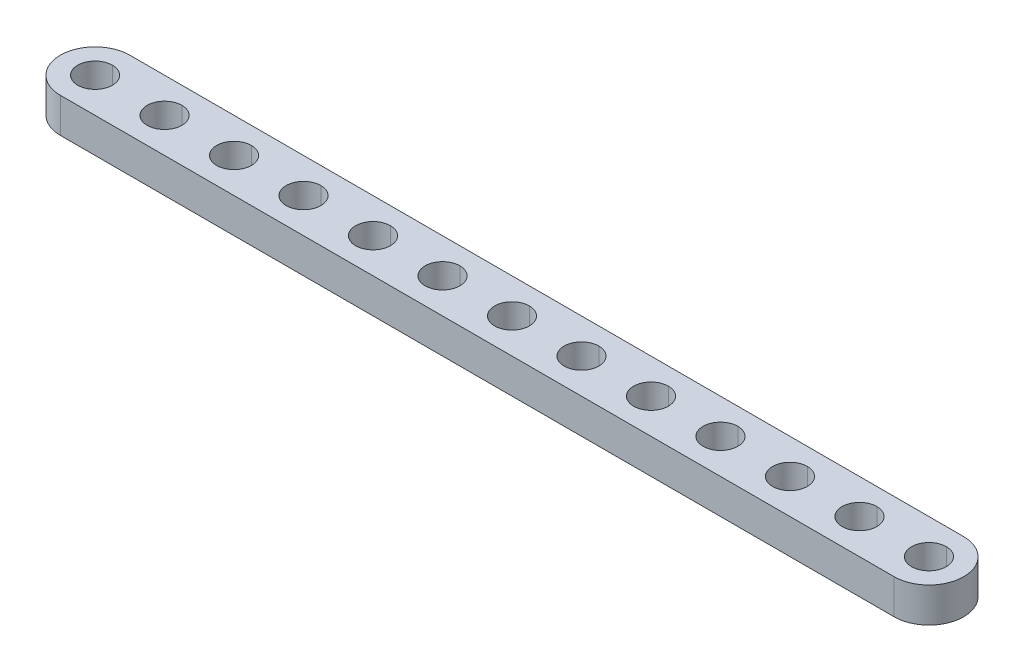
ISO-10303-21;
HEADER;
FILE_DESCRIPTION(('STEP AP214'),'2;1');
FILE_NAME('part.step','',(''),(''),'','','');
FILE_SCHEMA(('AUTOMOTIVE_DESIGN { 1 0 10303 214 1 1 1 1 }'));
ENDSEC;
DATA;
#1=APPLICATION_CONTEXT('core data for automotive mechanical design processes');
#2=APPLICATION_PROTOCOL_DEFINITION('international standard','automotive_design',2000,#1);
#3=PRODUCT_CONTEXT('',#1,'mechanical');
#4=PRODUCT('Part','Part','',(#3));
#5=PRODUCT_RELATED_PRODUCT_CATEGORY('part','',(#4));
#6=PRODUCT_DEFINITION_FORMATION('','',#4);
#7=PRODUCT_DEFINITION_CONTEXT('part definition',#1,'design');
#8=PRODUCT_DEFINITION('design','',#6,#7);
#9=PRODUCT_DEFINITION_SHAPE('','',#8);
#10=(LENGTH_UNIT() NAMED_UNIT(*) SI_UNIT(.MILLI.,.METRE.));
#11=(NAMED_UNIT(*) PLANE_ANGLE_UNIT() SI_UNIT($,.RADIAN.));
#12=(NAMED_UNIT(*) SI_UNIT($,.STERADIAN.) SOLID_ANGLE_UNIT());
#13=UNCERTAINTY_MEASURE_WITH_UNIT(LENGTH_MEASURE(1.E-05),#10,'distance_accuracy_value','');
#14=(GEOMETRIC_REPRESENTATION_CONTEXT(3) GLOBAL_UNCERTAINTY_ASSIGNED_CONTEXT((#13)) GLOBAL_UNIT_ASSIGNED_CONTEXT((#10,
#11,#12)) REPRESENTATION_CONTEXT('',''));
#15=CARTESIAN_POINT('',(0.,0.,0.));
#16=DIRECTION('',(0.,0.,1.));
#17=DIRECTION('',(1.,0.,0.));
#18=AXIS2_PLACEMENT_3D('',#15,#16,#17);
#19=CARTESIAN_POINT('',(48.,4.,0.));
#20=DIRECTION('',(0.,1.,0.));
#21=DIRECTION('',(0.,0.,1.));
#22=AXIS2_PLACEMENT_3D('',#19,#20,#21);
#23=CYLINDRICAL_SURFACE('',#22,2.);
#24=DIRECTION('',(0.,1.,0.));
#25=VECTOR('',#24,1.);
#26=CARTESIAN_POINT('',(48.,4.,-2.));
#27=LINE('',#26,#25);
#28=CARTESIAN_POINT('',(48.,0.,-2.));
#29=VERTEX_POINT('',#28);
#30=CARTESIAN_POINT('',(48.,4.,-2.));
#31=VERTEX_POINT('',#30);
#32=EDGE_CURVE('E343',#29,#31,#27,.T.);
#33=ORIENTED_EDGE('',*,*,#32,.F.);
#34=CARTESIAN_POINT('',(48.,0.,0.));
#35=DIRECTION('',(0.,1.,0.));
#36=DIRECTION('',(0.,0.,1.));
#37=AXIS2_PLACEMENT_3D('',#34,#35,#36);
#38=CIRCLE('',#37,2.);
#39=CARTESIAN_POINT('',(48.,0.,2.));
#40=VERTEX_POINT('',#39);
#41=EDGE_CURVE('E283',#40,#29,#38,.T.);
#42=ORIENTED_EDGE('',*,*,#41,.F.);
#43=DIRECTION('',(0.,1.,0.));
#44=VECTOR('',#43,1.);
#45=CARTESIAN_POINT('',(48.,4.,2.));
#46=LINE('',#45,#44);
#47=CARTESIAN_POINT('',(48.,4.,2.));
#48=VERTEX_POINT('',#47);
#49=EDGE_CURVE('E342',#40,#48,#46,.T.);
#50=ORIENTED_EDGE('',*,*,#49,.T.);
#51=CARTESIAN_POINT('',(48.,4.,0.));
#52=DIRECTION('',(0.,1.,0.));
#53=DIRECTION('',(0.,0.,1.));
#54=AXIS2_PLACEMENT_3D('',#51,#52,#53);
#55=CIRCLE('',#54,2.);
#56=EDGE_CURVE('E308',#48,#31,#55,.T.);
#57=ORIENTED_EDGE('',*,*,#56,.T.);
#58=EDGE_LOOP('',(#33,#42,#50,#57));
#59=FACE_BOUND('',#58,.T.);
#60=ADVANCED_FACE('F15',(#59),#23,.F.);
#61=CARTESIAN_POINT('',(40.,4.,0.));
#62=DIRECTION('',(0.,1.,0.));
#63=DIRECTION('',(0.,0.,1.));
#64=AXIS2_PLACEMENT_3D('',#61,#62,#63);
#65=CYLINDRICAL_SURFACE('',#64,2.);
#66=DIRECTION('',(0.,1.,0.));
#67=VECTOR('',#66,1.);
#68=CARTESIAN_POINT('',(40.,4.,-2.));
#69=LINE('',#68,#67);
#70=CARTESIAN_POINT('',(40.,0.,-2.));
#71=VERTEX_POINT('',#70);
#72=CARTESIAN_POINT('',(40.,4.,-2.));
#73=VERTEX_POINT('',#72);
#74=EDGE_CURVE('E311',#71,#73,#69,.T.);
#75=ORIENTED_EDGE('',*,*,#74,.F.);
#76=CARTESIAN_POINT('',(40.,0.,0.));
#77=DIRECTION('',(0.,1.,0.));
#78=DIRECTION('',(0.,0.,1.));
#79=AXIS2_PLACEMENT_3D('',#76,#77,#78);
#80=CIRCLE('',#79,2.);
#81=CARTESIAN_POINT('',(40.,0.,2.));
#82=VERTEX_POINT('',#81);
#83=EDGE_CURVE('E492',#82,#71,#80,.T.);
#84=ORIENTED_EDGE('',*,*,#83,.F.);
#85=DIRECTION('',(0.,1.,0.));
#86=VECTOR('',#85,1.);
#87=CARTESIAN_POINT('',(40.,4.,2.));
#88=LINE('',#87,#86);
#89=CARTESIAN_POINT('',(40.,4.,2.));
#90=VERTEX_POINT('',#89);
#91=EDGE_CURVE('E333',#82,#90,#88,.T.);
#92=ORIENTED_EDGE('',*,*,#91,.T.);
#93=CARTESIAN_POINT('',(40.,4.,0.));
#94=DIRECTION('',(0.,1.,0.));
#95=DIRECTION('',(0.,0.,1.));
#96=AXIS2_PLACEMENT_3D('',#93,#94,#95);
#97=CIRCLE('',#96,2.);
#98=EDGE_CURVE('E310',#90,#73,#97,.T.);
#99=ORIENTED_EDGE('',*,*,#98,.T.);
#100=EDGE_LOOP('',(#75,#84,#92,#99));
#101=FACE_BOUND('',#100,.T.);
#102=ADVANCED_FACE('F683',(#101),#65,.F.);
#103=CARTESIAN_POINT('',(32.,4.,0.));
#104=DIRECTION('',(0.,1.,0.));
#105=DIRECTION('',(0.,0.,1.));
#106=AXIS2_PLACEMENT_3D('',#103,#104,#105);
#107=CYLINDRICAL_SURFACE('',#106,2.);
#108=DIRECTION('',(0.,1.,0.));
#109=VECTOR('',#108,1.);
#110=CARTESIAN_POINT('',(32.,4.,-2.));
#111=LINE('',#110,#109);
#112=CARTESIAN_POINT('',(32.,0.,-2.));
#113=VERTEX_POINT('',#112);
#114=CARTESIAN_POINT('',(32.,4.,-2.));
#115=VERTEX_POINT('',#114);
#116=EDGE_CURVE('E456',#113,#115,#111,.T.);
#117=ORIENTED_EDGE('',*,*,#116,.F.);
#118=CARTESIAN_POINT('',(32.,0.,0.));
#119=DIRECTION('',(0.,1.,0.));
#120=DIRECTION('',(0.,0.,1.));
#121=AXIS2_PLACEMENT_3D('',#118,#119,#120);
#122=CIRCLE('',#121,2.);
#123=CARTESIAN_POINT('',(32.,0.,2.));
#124=VERTEX_POINT('',#123);
#125=EDGE_CURVE('E464',#124,#113,#122,.T.);
#126=ORIENTED_EDGE('',*,*,#125,.F.);
#127=DIRECTION('',(0.,1.,0.));
#128=VECTOR('',#127,1.);
#129=CARTESIAN_POINT('',(32.,4.,2.));
#130=LINE('',#129,#128);
#131=CARTESIAN_POINT('',(32.,4.,2.));
#132=VERTEX_POINT('',#131);
#133=EDGE_CURVE('E455',#124,#132,#130,.T.);
#134=ORIENTED_EDGE('',*,*,#133,.T.);
#135=CARTESIAN_POINT('',(32.,4.,0.));
#136=DIRECTION('',(0.,1.,0.));
#137=DIRECTION('',(0.,0.,1.));
#138=AXIS2_PLACEMENT_3D('',#135,#136,#137);
#139=CIRCLE('',#138,2.);
#140=EDGE_CURVE('E417',#132,#115,#139,.T.);
#141=ORIENTED_EDGE('',*,*,#140,.T.);
#142=EDGE_LOOP('',(#117,#126,#134,#141));
#143=FACE_BOUND('',#142,.T.);
#144=ADVANCED_FACE('F1034',(#143),#107,.F.);
#145=CARTESIAN_POINT('',(24.,4.,0.));
#146=DIRECTION('',(0.,1.,0.));
#147=DIRECTION('',(0.,0.,1.));
#148=AXIS2_PLACEMENT_3D('',#145,#146,#147);
#149=CYLINDRICAL_SURFACE('',#148,2.);
#150=DIRECTION('',(0.,1.,0.));
#151=VECTOR('',#150,1.);
#152=CARTESIAN_POINT('',(24.,4.,-2.));
#153=LINE('',#152,#151);
#154=CARTESIAN_POINT('',(24.,0.,-2.));
#155=VERTEX_POINT('',#154);
#156=CARTESIAN_POINT('',(24.,4.,-2.));
#157=VERTEX_POINT('',#156);
#158=EDGE_CURVE('E372',#155,#157,#153,.T.);
#159=ORIENTED_EDGE('',*,*,#158,.F.);
#160=CARTESIAN_POINT('',(24.,0.,0.));
#161=DIRECTION('',(0.,1.,0.));
#162=DIRECTION('',(0.,0.,1.));
#163=AXIS2_PLACEMENT_3D('',#160,#161,#162);
#164=CIRCLE('',#163,2.);
#165=CARTESIAN_POINT('',(24.,0.,2.));
#166=VERTEX_POINT('',#165);
#167=EDGE_CURVE('E460',#166,#155,#164,.T.);
#168=ORIENTED_EDGE('',*,*,#167,.F.);
#169=DIRECTION('',(0.,1.,0.));
#170=VECTOR('',#169,1.);
#171=CARTESIAN_POINT('',(24.,4.,2.));
#172=LINE('',#171,#170);
#173=CARTESIAN_POINT('',(24.,4.,2.));
#174=VERTEX_POINT('',#173);
#175=EDGE_CURVE('E328',#166,#174,#172,.T.);
#176=ORIENTED_EDGE('',*,*,#175,.T.);
#177=CARTESIAN_POINT('',(24.,4.,0.));
#178=DIRECTION('',(0.,1.,0.));
#179=DIRECTION('',(0.,0.,1.));
#180=AXIS2_PLACEMENT_3D('',#177,#178,#179);
#181=CIRCLE('',#180,2.);
#182=EDGE_CURVE('E431',#174,#157,#181,.T.);
#183=ORIENTED_EDGE('',*,*,#182,.T.);
#184=EDGE_LOOP('',(#159,#168,#176,#183));
#185=FACE_BOUND('',#184,.T.);
#186=ADVANCED_FACE('F1038',(#185),#149,.F.);
#187=CARTESIAN_POINT('',(16.,4.,0.));
#188=DIRECTION('',(0.,1.,0.));
#189=DIRECTION('',(0.,0.,1.));
#190=AXIS2_PLACEMENT_3D('',#187,#188,#189);
#191=CYLINDRICAL_SURFACE('',#190,2.);
#192=DIRECTION('',(0.,1.,0.));
#193=VECTOR('',#192,1.);
#194=CARTESIAN_POINT('',(16.,4.,-2.));
#195=LINE('',#194,#193);
#196=CARTESIAN_POINT('',(16.,0.,-2.));
#197=VERTEX_POINT('',#196);
#198=CARTESIAN_POINT('',(16.,4.,-2.));
#199=VERTEX_POINT('',#198);
#200=EDGE_CURVE('E327',#197,#199,#195,.T.);
#201=ORIENTED_EDGE('',*,*,#200,.F.);
#202=CARTESIAN_POINT('',(16.,0.,0.));
#203=DIRECTION('',(0.,1.,0.));
#204=DIRECTION('',(0.,0.,1.));
#205=AXIS2_PLACEMENT_3D('',#202,#203,#204);
#206=CIRCLE('',#205,2.);
#207=CARTESIAN_POINT('',(16.,0.,2.));
#208=VERTEX_POINT('',#207);
#209=EDGE_CURVE('E463',#208,#197,#206,.T.);
#210=ORIENTED_EDGE('',*,*,#209,.F.);
#211=DIRECTION('',(0.,1.,0.));
#212=VECTOR('',#211,1.);
#213=CARTESIAN_POINT('',(16.,4.,2.));
#214=LINE('',#213,#212);
#215=CARTESIAN_POINT('',(16.,4.,2.));
#216=VERTEX_POINT('',#215);
#217=EDGE_CURVE('E392',#208,#216,#214,.T.);
#218=ORIENTED_EDGE('',*,*,#217,.T.);
#219=CARTESIAN_POINT('',(16.,4.,0.));
#220=DIRECTION('',(0.,1.,0.));
#221=DIRECTION('',(0.,0.,1.));
#222=AXIS2_PLACEMENT_3D('',#219,#220,#221);
#223=CIRCLE('',#222,2.);
#224=EDGE_CURVE('E427',#216,#199,#223,.T.);
#225=ORIENTED_EDGE('',*,*,#224,.T.);
#226=EDGE_LOOP('',(#201,#210,#218,#225));
#227=FACE_BOUND('',#226,.T.);
#228=ADVANCED_FACE('F996',(#227),#191,.F.);
#229=CARTESIAN_POINT('',(8.,4.,0.));
#230=DIRECTION('',(0.,1.,0.));
#231=DIRECTION('',(0.,0.,1.));
#232=AXIS2_PLACEMENT_3D('',#229,#230,#231);
#233=CYLINDRICAL_SURFACE('',#232,2.);
#234=DIRECTION('',(0.,1.,0.));
#235=VECTOR('',#234,1.);
#236=CARTESIAN_POINT('',(8.,4.,-2.));
#237=LINE('',#236,#235);
#238=CARTESIAN_POINT('',(8.,0.,-2.));
#239=VERTEX_POINT('',#238);
#240=CARTESIAN_POINT('',(8.,4.,-2.));
#241=VERTEX_POINT('',#240);
#242=EDGE_CURVE('E423',#239,#241,#237,.T.);
#243=ORIENTED_EDGE('',*,*,#242,.F.);
#244=CARTESIAN_POINT('',(8.,0.,0.));
#245=DIRECTION('',(0.,1.,0.));
#246=DIRECTION('',(0.,0.,1.));
#247=AXIS2_PLACEMENT_3D('',#244,#245,#246);
#248=CIRCLE('',#247,2.);
#249=CARTESIAN_POINT('',(8.,0.,2.));
#250=VERTEX_POINT('',#249);
#251=EDGE_CURVE('E480',#250,#239,#248,.T.);
#252=ORIENTED_EDGE('',*,*,#251,.F.);
#253=DIRECTION('',(0.,1.,0.));
#254=VECTOR('',#253,1.);
#255=CARTESIAN_POINT('',(8.,4.,2.));
#256=LINE('',#255,#254);
#257=CARTESIAN_POINT('',(8.,4.,2.));
#258=VERTEX_POINT('',#257);
#259=EDGE_CURVE('E422',#250,#258,#256,.T.);
#260=ORIENTED_EDGE('',*,*,#259,.T.);
#261=CARTESIAN_POINT('',(8.,4.,0.));
#262=DIRECTION('',(0.,1.,0.));
#263=DIRECTION('',(0.,0.,1.));
#264=AXIS2_PLACEMENT_3D('',#261,#262,#263);
#265=CIRCLE('',#264,2.);
#266=EDGE_CURVE('E430',#258,#241,#265,.T.);
#267=ORIENTED_EDGE('',*,*,#266,.T.);
#268=EDGE_LOOP('',(#243,#252,#260,#267));
#269=FACE_BOUND('',#268,.T.);
#270=ADVANCED_FACE('F650',(#269),#233,.F.);
#271=CARTESIAN_POINT('',(0.,4.,0.));
#272=DIRECTION('',(0.,1.,0.));
#273=DIRECTION('',(0.,0.,1.));
#274=AXIS2_PLACEMENT_3D('',#271,#272,#273);
#275=CYLINDRICAL_SURFACE('',#274,2.);
#276=DIRECTION('',(0.,1.,0.));
#277=VECTOR('',#276,1.);
#278=CARTESIAN_POINT('',(0.,4.,-2.));
#279=LINE('',#278,#277);
#280=CARTESIAN_POINT('',(0.,0.,-2.));
#281=VERTEX_POINT('',#280);
#282=CARTESIAN_POINT('',(0.,4.,-2.));
#283=VERTEX_POINT('',#282);
#284=EDGE_CURVE('E509',#281,#283,#279,.T.);
#285=ORIENTED_EDGE('',*,*,#284,.F.);
#286=CARTESIAN_POINT('',(0.,0.,0.));
#287=DIRECTION('',(0.,1.,0.));
#288=DIRECTION('',(0.,0.,1.));
#289=AXIS2_PLACEMENT_3D('',#286,#287,#288);
#290=CIRCLE('',#289,2.);
#291=CARTESIAN_POINT('',(0.,0.,2.));
#292=VERTEX_POINT('',#291);
#293=EDGE_CURVE('E477',#292,#281,#290,.T.);
#294=ORIENTED_EDGE('',*,*,#293,.F.);
#295=DIRECTION('',(0.,1.,0.));
#296=VECTOR('',#295,1.);
#297=CARTESIAN_POINT('',(0.,4.,2.));
#298=LINE('',#297,#296);
#299=CARTESIAN_POINT('',(0.,4.,2.));
#300=VERTEX_POINT('',#299);
#301=EDGE_CURVE('E405',#292,#300,#298,.T.);
#302=ORIENTED_EDGE('',*,*,#301,.T.);
#303=CARTESIAN_POINT('',(0.,4.,0.));
#304=DIRECTION('',(0.,1.,0.));
#305=DIRECTION('',(0.,0.,1.));
#306=AXIS2_PLACEMENT_3D('',#303,#304,#305);
#307=CIRCLE('',#306,2.);
#308=EDGE_CURVE('E486',#300,#283,#307,.T.);
#309=ORIENTED_EDGE('',*,*,#308,.T.);
#310=EDGE_LOOP('',(#285,#294,#302,#309));
#311=FACE_BOUND('',#310,.T.);
#312=ADVANCED_FACE('F567',(#311),#275,.F.);
#313=CARTESIAN_POINT('',(-8.,4.,0.));
#314=DIRECTION('',(0.,1.,0.));
#315=DIRECTION('',(0.,0.,1.));
#316=AXIS2_PLACEMENT_3D('',#313,#314,#315);
#317=CYLINDRICAL_SURFACE('',#316,2.);
#318=DIRECTION('',(0.,1.,0.));
#319=VECTOR('',#318,1.);
#320=CARTESIAN_POINT('',(-8.,4.,-2.));
#321=LINE('',#320,#319);
#322=CARTESIAN_POINT('',(-8.,0.,-2.));
#323=VERTEX_POINT('',#322);
#324=CARTESIAN_POINT('',(-8.,4.,-2.));
#325=VERTEX_POINT('',#324);
#326=EDGE_CURVE('E445',#323,#325,#321,.T.);
#327=ORIENTED_EDGE('',*,*,#326,.F.);
#328=CARTESIAN_POINT('',(-8.,0.,0.));
#329=DIRECTION('',(0.,1.,0.));
#330=DIRECTION('',(0.,0.,1.));
#331=AXIS2_PLACEMENT_3D('',#328,#329,#330);
#332=CIRCLE('',#331,2.);
#333=CARTESIAN_POINT('',(-8.,0.,2.));
#334=VERTEX_POINT('',#333);
#335=EDGE_CURVE('E467',#334,#323,#332,.T.);
#336=ORIENTED_EDGE('',*,*,#335,.F.);
#337=DIRECTION('',(0.,1.,0.));
#338=VECTOR('',#337,1.);
#339=CARTESIAN_POINT('',(-8.,4.,2.));
#340=LINE('',#339,#338);
#341=CARTESIAN_POINT('',(-8.,4.,2.));
#342=VERTEX_POINT('',#341);
#343=EDGE_CURVE('E378',#334,#342,#340,.T.);
#344=ORIENTED_EDGE('',*,*,#343,.T.);
#345=CARTESIAN_POINT('',(-8.,4.,0.));
#346=DIRECTION('',(0.,1.,0.));
#347=DIRECTION('',(0.,0.,1.));
#348=AXIS2_PLACEMENT_3D('',#345,#346,#347);
#349=CIRCLE('',#348,2.);
#350=EDGE_CURVE('E512',#342,#325,#349,.T.);
#351=ORIENTED_EDGE('',*,*,#350,.T.);
#352=EDGE_LOOP('',(#327,#336,#344,#351));
#353=FACE_BOUND('',#352,.T.);
#354=ADVANCED_FACE('F971',(#353),#317,.F.);
#355=CARTESIAN_POINT('',(-16.,4.,0.));
#356=DIRECTION('',(0.,1.,0.));
#357=DIRECTION('',(0.,0.,1.));
#358=AXIS2_PLACEMENT_3D('',#355,#356,#357);
#359=CYLINDRICAL_SURFACE('',#358,2.);
#360=DIRECTION('',(0.,1.,0.));
#361=VECTOR('',#360,1.);
#362=CARTESIAN_POINT('',(-16.,4.,-2.));
#363=LINE('',#362,#361);
#364=CARTESIAN_POINT('',(-16.,0.,-2.));
#365=VERTEX_POINT('',#364);
#366=CARTESIAN_POINT('',(-16.,4.,-2.));
#367=VERTEX_POINT('',#366);
#368=EDGE_CURVE('E516',#365,#367,#363,.T.);
#369=ORIENTED_EDGE('',*,*,#368,.F.);
#370=CARTESIAN_POINT('',(-16.,0.,0.));
#371=DIRECTION('',(0.,1.,0.));
#372=DIRECTION('',(0.,0.,1.));
#373=AXIS2_PLACEMENT_3D('',#370,#371,#372);
#374=CIRCLE('',#373,2.);
#375=CARTESIAN_POINT('',(-16.,0.,2.));
#376=VERTEX_POINT('',#375);
#377=EDGE_CURVE('E72',#376,#365,#374,.T.);
#378=ORIENTED_EDGE('',*,*,#377,.F.);
#379=DIRECTION('',(0.,1.,0.));
#380=VECTOR('',#379,1.);
#381=CARTESIAN_POINT('',(-16.,4.,2.));
#382=LINE('',#381,#380);
#383=CARTESIAN_POINT('',(-16.,4.,2.));
#384=VERTEX_POINT('',#383);
#385=EDGE_CURVE('E373',#376,#384,#382,.T.);
#386=ORIENTED_EDGE('',*,*,#385,.T.);
#387=CARTESIAN_POINT('',(-16.,4.,0.));
#388=DIRECTION('',(0.,1.,0.));
#389=DIRECTION('',(0.,0.,1.));
#390=AXIS2_PLACEMENT_3D('',#387,#388,#389);
#391=CIRCLE('',#390,2.);
#392=EDGE_CURVE('E357',#384,#367,#391,.T.);
#393=ORIENTED_EDGE('',*,*,#392,.T.);
#394=EDGE_LOOP('',(#369,#378,#386,#393));
#395=FACE_BOUND('',#394,.T.);
#396=ADVANCED_FACE('F966',(#395),#359,.F.);
#397=CARTESIAN_POINT('',(-24.,4.,0.));
#398=DIRECTION('',(0.,1.,0.));
#399=DIRECTION('',(0.,0.,1.));
#400=AXIS2_PLACEMENT_3D('',#397,#398,#399);
#401=CYLINDRICAL_SURFACE('',#400,2.);
#402=DIRECTION('',(0.,1.,0.));
#403=VECTOR('',#402,1.);
#404=CARTESIAN_POINT('',(-24.,4.,-2.));
#405=LINE('',#404,#403);
#406=CARTESIAN_POINT('',(-24.,0.,-2.));
#407=VERTEX_POINT('',#406);
#408=CARTESIAN_POINT('',(-24.,4.,-2.));
#409=VERTEX_POINT('',#408);
#410=EDGE_CURVE('E387',#407,#409,#405,.T.);
#411=ORIENTED_EDGE('',*,*,#410,.F.);
#412=CARTESIAN_POINT('',(-24.,0.,0.));
#413=DIRECTION('',(0.,1.,0.));
#414=DIRECTION('',(0.,0.,1.));
#415=AXIS2_PLACEMENT_3D('',#412,#413,#414);
#416=CIRCLE('',#415,2.);
#417=CARTESIAN_POINT('',(-24.,0.,2.));
#418=VERTEX_POINT('',#417);
#419=EDGE_CURVE('E362',#418,#407,#416,.T.);
#420=ORIENTED_EDGE('',*,*,#419,.F.);
#421=DIRECTION('',(0.,1.,0.));
#422=VECTOR('',#421,1.);
#423=CARTESIAN_POINT('',(-24.,4.,2.));
#424=LINE('',#423,#422);
#425=CARTESIAN_POINT('',(-24.,4.,2.));
#426=VERTEX_POINT('',#425);
#427=EDGE_CURVE('E317',#418,#426,#424,.T.);
#428=ORIENTED_EDGE('',*,*,#427,.T.);
#429=CARTESIAN_POINT('',(-24.,4.,0.));
#430=DIRECTION('',(0.,1.,0.));
#431=DIRECTION('',(0.,0.,1.));
#432=AXIS2_PLACEMENT_3D('',#429,#430,#431);
#433=CIRCLE('',#432,2.);
#434=EDGE_CURVE('E353',#426,#409,#433,.T.);
#435=ORIENTED_EDGE('',*,*,#434,.T.);
#436=EDGE_LOOP('',(#411,#420,#428,#435));
#437=FACE_BOUND('',#436,.T.);
#438=ADVANCED_FACE('F970',(#437),#401,.F.);
#439=CARTESIAN_POINT('',(-32.,4.,0.));
#440=DIRECTION('',(0.,1.,0.));
#441=DIRECTION('',(0.,0.,1.));
#442=AXIS2_PLACEMENT_3D('',#439,#440,#441);
#443=CYLINDRICAL_SURFACE('',#442,2.);
#444=DIRECTION('',(0.,1.,0.));
#445=VECTOR('',#444,1.);
#446=CARTESIAN_POINT('',(-32.,4.,-2.));
#447=LINE('',#446,#445);
#448=CARTESIAN_POINT('',(-32.,0.,-2.));
#449=VERTEX_POINT('',#448);
#450=CARTESIAN_POINT('',(-32.,4.,-2.));
#451=VERTEX_POINT('',#450);
#452=EDGE_CURVE('E404',#449,#451,#447,.T.);
#453=ORIENTED_EDGE('',*,*,#452,.F.);
#454=CARTESIAN_POINT('',(-32.,0.,0.));
#455=DIRECTION('',(0.,1.,0.));
#456=DIRECTION('',(0.,0.,1.));
#457=AXIS2_PLACEMENT_3D('',#454,#455,#456);
#458=CIRCLE('',#457,2.);
#459=CARTESIAN_POINT('',(-32.,0.,2.));
#460=VERTEX_POINT('',#459);
#461=EDGE_CURVE('E365',#460,#449,#458,.T.);
#462=ORIENTED_EDGE('',*,*,#461,.F.);
#463=DIRECTION('',(0.,1.,0.));
#464=VECTOR('',#463,1.);
#465=CARTESIAN_POINT('',(-32.,4.,2.));
#466=LINE('',#465,#464);
#467=CARTESIAN_POINT('',(-32.,4.,2.));
#468=VERTEX_POINT('',#467);
#469=EDGE_CURVE('E432',#460,#468,#466,.T.);
#470=ORIENTED_EDGE('',*,*,#469,.T.);
#471=CARTESIAN_POINT('',(-32.,4.,0.));
#472=DIRECTION('',(0.,1.,0.));
#473=DIRECTION('',(0.,0.,1.));
#474=AXIS2_PLACEMENT_3D('',#471,#472,#473);
#475=CIRCLE('',#474,2.);
#476=EDGE_CURVE('E356',#468,#451,#475,.T.);
#477=ORIENTED_EDGE('',*,*,#476,.T.);
#478=EDGE_LOOP('',(#453,#462,#470,#477));
#479=FACE_BOUND('',#478,.T.);
#480=ADVANCED_FACE('F1001',(#479),#443,.F.);
#481=CARTESIAN_POINT('',(-40.,4.,0.));
#482=DIRECTION('',(0.,1.,0.));
#483=DIRECTION('',(0.,0.,1.));
#484=AXIS2_PLACEMENT_3D('',#481,#482,#483);
#485=CYLINDRICAL_SURFACE('',#484,2.);
#486=DIRECTION('',(0.,1.,0.));
#487=VECTOR('',#486,1.);
#488=CARTESIAN_POINT('',(-40.,4.,-2.));
#489=LINE('',#488,#487);
#490=CARTESIAN_POINT('',(-40.,0.,-2.));
#491=VERTEX_POINT('',#490);
#492=CARTESIAN_POINT('',(-40.,4.,-2.));
#493=VERTEX_POINT('',#492);
#494=EDGE_CURVE('E344',#491,#493,#489,.T.);
#495=ORIENTED_EDGE('',*,*,#494,.F.);
#496=CARTESIAN_POINT('',(-40.,0.,0.));
#497=DIRECTION('',(0.,1.,0.));
#498=DIRECTION('',(0.,0.,1.));
#499=AXIS2_PLACEMENT_3D('',#496,#497,#498);
#500=CIRCLE('',#499,2.);
#501=CARTESIAN_POINT('',(-40.,0.,2.));
#502=VERTEX_POINT('',#501);
#503=EDGE_CURVE('E25',#502,#491,#500,.T.);
#504=ORIENTED_EDGE('',*,*,#503,.F.);
#505=DIRECTION('',(0.,1.,0.));
#506=VECTOR('',#505,1.);
#507=CARTESIAN_POINT('',(-40.,4.,2.));
#508=LINE('',#507,#506);
#509=CARTESIAN_POINT('',(-40.,4.,2.));
#510=VERTEX_POINT('',#509);
#511=EDGE_CURVE('E302',#502,#510,#508,.T.);
#512=ORIENTED_EDGE('',*,*,#511,.T.);
#513=CARTESIAN_POINT('',(-40.,4.,0.));
#514=DIRECTION('',(0.,1.,0.));
#515=DIRECTION('',(0.,0.,1.));
#516=AXIS2_PLACEMENT_3D('',#513,#514,#515);
#517=CIRCLE('',#516,2.);
#518=EDGE_CURVE('E284',#510,#493,#517,.T.);
#519=ORIENTED_EDGE('',*,*,#518,.T.);
#520=EDGE_LOOP('',(#495,#504,#512,#519));
#521=FACE_BOUND('',#520,.T.);
#522=ADVANCED_FACE('F1005',(#521),#485,.F.);
#523=CARTESIAN_POINT('',(-48.,4.,0.));
#524=DIRECTION('',(0.,1.,0.));
#525=DIRECTION('',(0.,0.,1.));
#526=AXIS2_PLACEMENT_3D('',#523,#524,#525);
#527=CYLINDRICAL_SURFACE('',#526,2.);
#528=DIRECTION('',(0.,1.,0.));
#529=VECTOR('',#528,1.);
#530=CARTESIAN_POINT('',(-48.,4.,-2.));
#531=LINE('',#530,#529);
#532=CARTESIAN_POINT('',(-48.,0.,-2.));
#533=VERTEX_POINT('',#532);
#534=CARTESIAN_POINT('',(-48.,4.,-2.));
#535=VERTEX_POINT('',#534);
#536=EDGE_CURVE('E276',#533,#535,#531,.T.);
#537=ORIENTED_EDGE('',*,*,#536,.F.);
#538=CARTESIAN_POINT('',(-48.,0.,0.));
#539=DIRECTION('',(0.,1.,0.));
#540=DIRECTION('',(0.,0.,1.));
#541=AXIS2_PLACEMENT_3D('',#538,#539,#540);
#542=CIRCLE('',#541,2.);
#543=CARTESIAN_POINT('',(-48.,0.,2.));
#544=VERTEX_POINT('',#543);
#545=EDGE_CURVE('E10',#544,#533,#542,.T.);
#546=ORIENTED_EDGE('',*,*,#545,.F.);
#547=DIRECTION('',(0.,1.,0.));
#548=VECTOR('',#547,1.);
#549=CARTESIAN_POINT('',(-48.,4.,2.));
#550=LINE('',#549,#548);
#551=CARTESIAN_POINT('',(-48.,4.,2.));
#552=VERTEX_POINT('',#551);
#553=EDGE_CURVE('E279',#544,#552,#550,.T.);
#554=ORIENTED_EDGE('',*,*,#553,.T.);
#555=CARTESIAN_POINT('',(-48.,4.,0.));
#556=DIRECTION('',(0.,1.,0.));
#557=DIRECTION('',(0.,0.,1.));
#558=AXIS2_PLACEMENT_3D('',#555,#556,#557);
#559=CIRCLE('',#558,2.);
#560=EDGE_CURVE('E272',#552,#535,#559,.T.);
#561=ORIENTED_EDGE('',*,*,#560,.T.);
#562=EDGE_LOOP('',(#537,#546,#554,#561));
#563=FACE_BOUND('',#562,.T.);
#564=ADVANCED_FACE('F274',(#563),#527,.F.);
#565=CARTESIAN_POINT('',(-48.,0.,0.));
#566=DIRECTION('',(0.,1.,0.));
#567=DIRECTION('',(1.,0.,0.));
#568=AXIS2_PLACEMENT_3D('',#565,#566,#567);
#569=PLANE('',#568);
#570=ORIENTED_EDGE('',*,*,#545,.T.);
#571=CARTESIAN_POINT('',(-48.,0.,0.));
#572=DIRECTION('',(0.,1.,0.));
#573=DIRECTION('',(0.,0.,1.));
#574=AXIS2_PLACEMENT_3D('',#571,#572,#573);
#575=CIRCLE('',#574,2.);
#576=EDGE_CURVE('E294',#533,#544,#575,.T.);
#577=ORIENTED_EDGE('',*,*,#576,.T.);
#578=EDGE_LOOP('',(#570,#577));
#579=FACE_BOUND('',#578,.T.);
#580=ORIENTED_EDGE('',*,*,#503,.T.);
#581=CARTESIAN_POINT('',(-40.,0.,0.));
#582=DIRECTION('',(0.,1.,0.));
#583=DIRECTION('',(0.,0.,1.));
#584=AXIS2_PLACEMENT_3D('',#581,#582,#583);
#585=CIRCLE('',#584,2.);
#586=EDGE_CURVE('E349',#491,#502,#585,.T.);
#587=ORIENTED_EDGE('',*,*,#586,.T.);
#588=EDGE_LOOP('',(#580,#587));
#589=FACE_BOUND('',#588,.T.);
#590=ORIENTED_EDGE('',*,*,#461,.T.);
#591=CARTESIAN_POINT('',(-32.,0.,0.));
#592=DIRECTION('',(0.,1.,0.));
#593=DIRECTION('',(0.,0.,1.));
#594=AXIS2_PLACEMENT_3D('',#591,#592,#593);
#595=CIRCLE('',#594,2.);
#596=EDGE_CURVE('E321',#449,#460,#595,.T.);
#597=ORIENTED_EDGE('',*,*,#596,.T.);
#598=EDGE_LOOP('',(#590,#597));
#599=FACE_BOUND('',#598,.T.);
#600=ORIENTED_EDGE('',*,*,#419,.T.);
#601=CARTESIAN_POINT('',(-24.,0.,0.));
#602=DIRECTION('',(0.,1.,0.));
#603=DIRECTION('',(0.,0.,1.));
#604=AXIS2_PLACEMENT_3D('',#601,#602,#603);
#605=CIRCLE('',#604,2.);
#606=EDGE_CURVE('E376',#407,#418,#605,.T.);
#607=ORIENTED_EDGE('',*,*,#606,.T.);
#608=EDGE_LOOP('',(#600,#607));
#609=FACE_BOUND('',#608,.T.);
#610=ORIENTED_EDGE('',*,*,#377,.T.);
#611=CARTESIAN_POINT('',(-16.,0.,0.));
#612=DIRECTION('',(0.,1.,0.));
#613=DIRECTION('',(0.,0.,1.));
#614=AXIS2_PLACEMENT_3D('',#611,#612,#613);
#615=CIRCLE('',#614,2.);
#616=EDGE_CURVE('E382',#365,#376,#615,.T.);
#617=ORIENTED_EDGE('',*,*,#616,.T.);
#618=EDGE_LOOP('',(#610,#617));
#619=FACE_BOUND('',#618,.T.);
#620=ORIENTED_EDGE('',*,*,#335,.T.);
#621=CARTESIAN_POINT('',(-8.,0.,0.));
#622=DIRECTION('',(0.,1.,0.));
#623=DIRECTION('',(0.,0.,1.));
#624=AXIS2_PLACEMENT_3D('',#621,#622,#623);
#625=CIRCLE('',#624,2.);
#626=EDGE_CURVE('E409',#323,#334,#625,.T.);
#627=ORIENTED_EDGE('',*,*,#626,.T.);
#628=EDGE_LOOP('',(#620,#627));
#629=FACE_BOUND('',#628,.T.);
#630=ORIENTED_EDGE('',*,*,#293,.T.);
#631=CARTESIAN_POINT('',(0.,0.,0.));
#632=DIRECTION('',(0.,1.,0.));
#633=DIRECTION('',(0.,0.,1.));
#634=AXIS2_PLACEMENT_3D('',#631,#632,#633);
#635=CIRCLE('',#634,2.);
#636=EDGE_CURVE('E474',#281,#292,#635,.T.);
#637=ORIENTED_EDGE('',*,*,#636,.T.);
#638=EDGE_LOOP('',(#630,#637));
#639=FACE_BOUND('',#638,.T.);
#640=ORIENTED_EDGE('',*,*,#251,.T.);
#641=CARTESIAN_POINT('',(8.,0.,0.));
#642=DIRECTION('',(0.,1.,0.));
#643=DIRECTION('',(0.,0.,1.));
#644=AXIS2_PLACEMENT_3D('',#641,#642,#643);
#645=CIRCLE('',#644,2.);
#646=EDGE_CURVE('E523',#239,#250,#645,.T.);
#647=ORIENTED_EDGE('',*,*,#646,.T.);
#648=EDGE_LOOP('',(#640,#647));
#649=FACE_BOUND('',#648,.T.);
#650=ORIENTED_EDGE('',*,*,#209,.T.);
#651=CARTESIAN_POINT('',(16.,0.,0.));
#652=DIRECTION('',(0.,1.,0.));
#653=DIRECTION('',(0.,0.,1.));
#654=AXIS2_PLACEMENT_3D('',#651,#652,#653);
#655=CIRCLE('',#654,2.);
#656=EDGE_CURVE('E323',#197,#208,#655,.T.);
#657=ORIENTED_EDGE('',*,*,#656,.T.);
#658=EDGE_LOOP('',(#650,#657));
#659=FACE_BOUND('',#658,.T.);
#660=ORIENTED_EDGE('',*,*,#167,.T.);
#661=CARTESIAN_POINT('',(24.,0.,0.));
#662=DIRECTION('',(0.,1.,0.));
#663=DIRECTION('',(0.,0.,1.));
#664=AXIS2_PLACEMENT_3D('',#661,#662,#663);
#665=CIRCLE('',#664,2.);
#666=EDGE_CURVE('E499',#155,#166,#665,.T.);
#667=ORIENTED_EDGE('',*,*,#666,.T.);
#668=EDGE_LOOP('',(#660,#667));
#669=FACE_BOUND('',#668,.T.);
#670=ORIENTED_EDGE('',*,*,#125,.T.);
#671=CARTESIAN_POINT('',(32.,0.,0.));
#672=DIRECTION('',(0.,1.,0.));
#673=DIRECTION('',(0.,0.,1.));
#674=AXIS2_PLACEMENT_3D('',#671,#672,#673);
#675=CIRCLE('',#674,2.);
#676=EDGE_CURVE('E337',#113,#124,#675,.T.);
#677=ORIENTED_EDGE('',*,*,#676,.T.);
#678=EDGE_LOOP('',(#670,#677));
#679=FACE_BOUND('',#678,.T.);
#680=ORIENTED_EDGE('',*,*,#83,.T.);
#681=CARTESIAN_POINT('',(40.,0.,0.));
#682=DIRECTION('',(0.,1.,0.));
#683=DIRECTION('',(0.,0.,1.));
#684=AXIS2_PLACEMENT_3D('',#681,#682,#683);
#685=CIRCLE('',#684,2.);
#686=EDGE_CURVE('E316',#71,#82,#685,.T.);
#687=ORIENTED_EDGE('',*,*,#686,.T.);
#688=EDGE_LOOP('',(#680,#687));
#689=FACE_BOUND('',#688,.T.);
#690=ORIENTED_EDGE('',*,*,#41,.T.);
#691=CARTESIAN_POINT('',(48.,0.,0.));
#692=DIRECTION('',(0.,1.,0.));
#693=DIRECTION('',(0.,0.,1.));
#694=AXIS2_PLACEMENT_3D('',#691,#692,#693);
#695=CIRCLE('',#694,2.);
#696=EDGE_CURVE('E500',#29,#40,#695,.T.);
#697=ORIENTED_EDGE('',*,*,#696,.T.);
#698=EDGE_LOOP('',(#690,#697));
#699=FACE_BOUND('',#698,.T.);
#700=CARTESIAN_POINT('',(-48.,0.,0.));
#701=DIRECTION('',(0.,1.,0.));
#702=DIRECTION('',(0.,0.,1.));
#703=AXIS2_PLACEMENT_3D('',#700,#701,#702);
#704=CIRCLE('',#703,4.);
#705=CARTESIAN_POINT('',(-48.,0.,-4.));
#706=VERTEX_POINT('',#705);
#707=CARTESIAN_POINT('',(-48.,0.,4.));
#708=VERTEX_POINT('',#707);
#709=EDGE_CURVE('E440',#706,#708,#704,.T.);
#710=ORIENTED_EDGE('',*,*,#709,.F.);
#711=DIRECTION('',(-1.,0.,0.));
#712=VECTOR('',#711,1.);
#713=CARTESIAN_POINT('',(-48.,0.,-4.));
#714=LINE('',#713,#712);
#715=CARTESIAN_POINT('',(48.,0.,-4.));
#716=VERTEX_POINT('',#715);
#717=EDGE_CURVE('E368',#716,#706,#714,.T.);
#718=ORIENTED_EDGE('',*,*,#717,.F.);
#719=CARTESIAN_POINT('',(48.,0.,0.));
#720=DIRECTION('',(0.,1.,0.));
#721=DIRECTION('',(0.,0.,1.));
#722=AXIS2_PLACEMENT_3D('',#719,#720,#721);
#723=CIRCLE('',#722,4.);
#724=CARTESIAN_POINT('',(48.,0.,4.));
#725=VERTEX_POINT('',#724);
#726=EDGE_CURVE('E306',#725,#716,#723,.T.);
#727=ORIENTED_EDGE('',*,*,#726,.F.);
#728=DIRECTION('',(1.,0.,0.));
#729=VECTOR('',#728,1.);
#730=CARTESIAN_POINT('',(-48.,0.,4.));
#731=LINE('',#730,#729);
#732=EDGE_CURVE('E393',#708,#725,#731,.T.);
#733=ORIENTED_EDGE('',*,*,#732,.F.);
#734=EDGE_LOOP('',(#710,#718,#727,#733));
#735=FACE_BOUND('',#734,.T.);
#736=ADVANCED_FACE('F547',(#579,#589,#599,#609,#619,#629,#639,#649,#659,#669,#679,#689,#699,
#735),#569,.F.);
#737=CARTESIAN_POINT('',(-48.,4.,0.));
#738=DIRECTION('',(0.,1.,0.));
#739=DIRECTION('',(1.,0.,0.));
#740=AXIS2_PLACEMENT_3D('',#737,#738,#739);
#741=PLANE('',#740);
#742=ORIENTED_EDGE('',*,*,#560,.F.);
#743=CARTESIAN_POINT('',(-48.,4.,0.));
#744=DIRECTION('',(0.,1.,0.));
#745=DIRECTION('',(0.,0.,1.));
#746=AXIS2_PLACEMENT_3D('',#743,#744,#745);
#747=CIRCLE('',#746,2.);
#748=EDGE_CURVE('E286',#535,#552,#747,.T.);
#749=ORIENTED_EDGE('',*,*,#748,.F.);
#750=EDGE_LOOP('',(#742,#749));
#751=FACE_BOUND('',#750,.T.);
#752=ORIENTED_EDGE('',*,*,#518,.F.);
#753=CARTESIAN_POINT('',(-40.,4.,0.));
#754=DIRECTION('',(0.,1.,0.));
#755=DIRECTION('',(0.,0.,1.));
#756=AXIS2_PLACEMENT_3D('',#753,#754,#755);
#757=CIRCLE('',#756,2.);
#758=EDGE_CURVE('E348',#493,#510,#757,.T.);
#759=ORIENTED_EDGE('',*,*,#758,.F.);
#760=EDGE_LOOP('',(#752,#759));
#761=FACE_BOUND('',#760,.T.);
#762=ORIENTED_EDGE('',*,*,#476,.F.);
#763=CARTESIAN_POINT('',(-32.,4.,0.));
#764=DIRECTION('',(0.,1.,0.));
#765=DIRECTION('',(0.,0.,1.));
#766=AXIS2_PLACEMENT_3D('',#763,#764,#765);
#767=CIRCLE('',#766,2.);
#768=EDGE_CURVE('E435',#451,#468,#767,.T.);
#769=ORIENTED_EDGE('',*,*,#768,.F.);
#770=EDGE_LOOP('',(#762,#769));
#771=FACE_BOUND('',#770,.T.);
#772=ORIENTED_EDGE('',*,*,#434,.F.);
#773=CARTESIAN_POINT('',(-24.,4.,0.));
#774=DIRECTION('',(0.,1.,0.));
#775=DIRECTION('',(0.,0.,1.));
#776=AXIS2_PLACEMENT_3D('',#773,#774,#775);
#777=CIRCLE('',#776,2.);
#778=EDGE_CURVE('E322',#409,#426,#777,.T.);
#779=ORIENTED_EDGE('',*,*,#778,.F.);
#780=EDGE_LOOP('',(#772,#779));
#781=FACE_BOUND('',#780,.T.);
#782=ORIENTED_EDGE('',*,*,#392,.F.);
#783=CARTESIAN_POINT('',(-16.,4.,0.));
#784=DIRECTION('',(0.,1.,0.));
#785=DIRECTION('',(0.,0.,1.));
#786=AXIS2_PLACEMENT_3D('',#783,#784,#785);
#787=CIRCLE('',#786,2.);
#788=EDGE_CURVE('E377',#367,#384,#787,.T.);
#789=ORIENTED_EDGE('',*,*,#788,.F.);
#790=EDGE_LOOP('',(#782,#789));
#791=FACE_BOUND('',#790,.T.);
#792=ORIENTED_EDGE('',*,*,#350,.F.);
#793=CARTESIAN_POINT('',(-8.,4.,0.));
#794=DIRECTION('',(0.,1.,0.));
#795=DIRECTION('',(0.,0.,1.));
#796=AXIS2_PLACEMENT_3D('',#793,#794,#795);
#797=CIRCLE('',#796,2.);
#798=EDGE_CURVE('E383',#325,#342,#797,.T.);
#799=ORIENTED_EDGE('',*,*,#798,.F.);
#800=EDGE_LOOP('',(#792,#799));
#801=FACE_BOUND('',#800,.T.);
#802=ORIENTED_EDGE('',*,*,#308,.F.);
#803=CARTESIAN_POINT('',(0.,4.,0.));
#804=DIRECTION('',(0.,1.,0.));
#805=DIRECTION('',(0.,0.,1.));
#806=AXIS2_PLACEMENT_3D('',#803,#804,#805);
#807=CIRCLE('',#806,2.);
#808=EDGE_CURVE('E410',#283,#300,#807,.T.);
#809=ORIENTED_EDGE('',*,*,#808,.F.);
#810=EDGE_LOOP('',(#802,#809));
#811=FACE_BOUND('',#810,.T.);
#812=ORIENTED_EDGE('',*,*,#266,.F.);
#813=CARTESIAN_POINT('',(8.,4.,0.));
#814=DIRECTION('',(0.,1.,0.));
#815=DIRECTION('',(0.,0.,1.));
#816=AXIS2_PLACEMENT_3D('',#813,#814,#815);
#817=CIRCLE('',#816,2.);
#818=EDGE_CURVE('E418',#241,#258,#817,.T.);
#819=ORIENTED_EDGE('',*,*,#818,.F.);
#820=EDGE_LOOP('',(#812,#819));
#821=FACE_BOUND('',#820,.T.);
#822=ORIENTED_EDGE('',*,*,#224,.F.);
#823=CARTESIAN_POINT('',(16.,4.,0.));
#824=DIRECTION('',(0.,1.,0.));
#825=DIRECTION('',(0.,0.,1.));
#826=AXIS2_PLACEMENT_3D('',#823,#824,#825);
#827=CIRCLE('',#826,2.);
#828=EDGE_CURVE('E388',#199,#216,#827,.T.);
#829=ORIENTED_EDGE('',*,*,#828,.F.);
#830=EDGE_LOOP('',(#822,#829));
#831=FACE_BOUND('',#830,.T.);
#832=ORIENTED_EDGE('',*,*,#182,.F.);
#833=CARTESIAN_POINT('',(24.,4.,0.));
#834=DIRECTION('',(0.,1.,0.));
#835=DIRECTION('',(0.,0.,1.));
#836=AXIS2_PLACEMENT_3D('',#833,#834,#835);
#837=CIRCLE('',#836,2.);
#838=EDGE_CURVE('E332',#157,#174,#837,.T.);
#839=ORIENTED_EDGE('',*,*,#838,.F.);
#840=EDGE_LOOP('',(#832,#839));
#841=FACE_BOUND('',#840,.T.);
#842=ORIENTED_EDGE('',*,*,#140,.F.);
#843=CARTESIAN_POINT('',(32.,4.,0.));
#844=DIRECTION('',(0.,1.,0.));
#845=DIRECTION('',(0.,0.,1.));
#846=AXIS2_PLACEMENT_3D('',#843,#844,#845);
#847=CIRCLE('',#846,2.);
#848=EDGE_CURVE('E451',#115,#132,#847,.T.);
#849=ORIENTED_EDGE('',*,*,#848,.F.);
#850=EDGE_LOOP('',(#842,#849));
#851=FACE_BOUND('',#850,.T.);
#852=ORIENTED_EDGE('',*,*,#98,.F.);
#853=CARTESIAN_POINT('',(40.,4.,0.));
#854=DIRECTION('',(0.,1.,0.));
#855=DIRECTION('',(0.,0.,1.));
#856=AXIS2_PLACEMENT_3D('',#853,#854,#855);
#857=CIRCLE('',#856,2.);
#858=EDGE_CURVE('E315',#73,#90,#857,.T.);
#859=ORIENTED_EDGE('',*,*,#858,.F.);
#860=EDGE_LOOP('',(#852,#859));
#861=FACE_BOUND('',#860,.T.);
#862=ORIENTED_EDGE('',*,*,#56,.F.);
#863=CARTESIAN_POINT('',(48.,4.,0.));
#864=DIRECTION('',(0.,1.,0.));
#865=DIRECTION('',(0.,0.,1.));
#866=AXIS2_PLACEMENT_3D('',#863,#864,#865);
#867=CIRCLE('',#866,2.);
#868=EDGE_CURVE('E338',#31,#48,#867,.T.);
#869=ORIENTED_EDGE('',*,*,#868,.F.);
#870=EDGE_LOOP('',(#862,#869));
#871=FACE_BOUND('',#870,.T.);
#872=CARTESIAN_POINT('',(-48.,4.,0.));
#873=DIRECTION('',(0.,1.,0.));
#874=DIRECTION('',(0.,0.,1.));
#875=AXIS2_PLACEMENT_3D('',#872,#873,#874);
#876=CIRCLE('',#875,4.);
#877=CARTESIAN_POINT('',(-48.,4.,-4.));
#878=VERTEX_POINT('',#877);
#879=CARTESIAN_POINT('',(-48.,4.,4.));
#880=VERTEX_POINT('',#879);
#881=EDGE_CURVE('E18',#878,#880,#876,.T.);
#882=ORIENTED_EDGE('',*,*,#881,.T.);
#883=DIRECTION('',(1.,0.,0.));
#884=VECTOR('',#883,1.);
#885=CARTESIAN_POINT('',(-48.,4.,4.));
#886=LINE('',#885,#884);
#887=CARTESIAN_POINT('',(48.,4.,4.));
#888=VERTEX_POINT('',#887);
#889=EDGE_CURVE('E414',#880,#888,#886,.T.);
#890=ORIENTED_EDGE('',*,*,#889,.T.);
#891=CARTESIAN_POINT('',(48.,4.,0.));
#892=DIRECTION('',(0.,1.,0.));
#893=DIRECTION('',(0.,0.,1.));
#894=AXIS2_PLACEMENT_3D('',#891,#892,#893);
#895=CIRCLE('',#894,4.);
#896=CARTESIAN_POINT('',(48.,4.,-4.));
#897=VERTEX_POINT('',#896);
#898=EDGE_CURVE('E361',#888,#897,#895,.T.);
#899=ORIENTED_EDGE('',*,*,#898,.T.);
#900=DIRECTION('',(-1.,0.,0.));
#901=VECTOR('',#900,1.);
#902=CARTESIAN_POINT('',(-48.,4.,-4.));
#903=LINE('',#902,#901);
#904=EDGE_CURVE('E40',#897,#878,#903,.T.);
#905=ORIENTED_EDGE('',*,*,#904,.T.);
#906=EDGE_LOOP('',(#882,#890,#899,#905));
#907=FACE_BOUND('',#906,.T.);
#908=ADVANCED_FACE('F287',(#751,#761,#771,#781,#791,#801,#811,#821,#831,#841,#851,#861,#871,
#907),#741,.T.);
#909=CARTESIAN_POINT('',(-48.,4.,-4.));
#910=DIRECTION('',(0.,0.,1.));
#911=DIRECTION('',(1.,0.,0.));
#912=AXIS2_PLACEMENT_3D('',#909,#910,#911);
#913=PLANE('',#912);
#914=ORIENTED_EDGE('',*,*,#717,.T.);
#915=DIRECTION('',(0.,-1.,0.));
#916=VECTOR('',#915,1.);
#917=CARTESIAN_POINT('',(-48.,4.,-4.));
#918=LINE('',#917,#916);
#919=EDGE_CURVE('E398',#878,#706,#918,.T.);
#920=ORIENTED_EDGE('',*,*,#919,.F.);
#921=ORIENTED_EDGE('',*,*,#904,.F.);
#922=DIRECTION('',(0.,-1.,0.));
#923=VECTOR('',#922,1.);
#924=CARTESIAN_POINT('',(48.,4.,-4.));
#925=LINE('',#924,#923);
#926=EDGE_CURVE('E358',#897,#716,#925,.T.);
#927=ORIENTED_EDGE('',*,*,#926,.T.);
#928=EDGE_LOOP('',(#914,#920,#921,#927));
#929=FACE_BOUND('',#928,.T.);
#930=ADVANCED_FACE('F618',(#929),#913,.F.);
#931=CARTESIAN_POINT('',(48.,4.,0.));
#932=DIRECTION('',(0.,-1.,0.));
#933=DIRECTION('',(0.,0.,-1.));
#934=AXIS2_PLACEMENT_3D('',#931,#932,#933);
#935=CYLINDRICAL_SURFACE('',#934,4.);
#936=ORIENTED_EDGE('',*,*,#726,.T.);
#937=ORIENTED_EDGE('',*,*,#926,.F.);
#938=ORIENTED_EDGE('',*,*,#898,.F.);
#939=DIRECTION('',(0.,-1.,0.));
#940=VECTOR('',#939,1.);
#941=CARTESIAN_POINT('',(48.,4.,4.));
#942=LINE('',#941,#940);
#943=EDGE_CURVE('E397',#888,#725,#942,.T.);
#944=ORIENTED_EDGE('',*,*,#943,.T.);
#945=EDGE_LOOP('',(#936,#937,#938,#944));
#946=FACE_BOUND('',#945,.T.);
#947=ADVANCED_FACE('F617',(#946),#935,.T.);
#948=CARTESIAN_POINT('',(-48.,4.,4.));
#949=DIRECTION('',(0.,0.,-1.));
#950=DIRECTION('',(0.,-1.,0.));
#951=AXIS2_PLACEMENT_3D('',#948,#949,#950);
#952=PLANE('',#951);
#953=ORIENTED_EDGE('',*,*,#732,.T.);
#954=ORIENTED_EDGE('',*,*,#943,.F.);
#955=ORIENTED_EDGE('',*,*,#889,.F.);
#956=DIRECTION('',(0.,-1.,0.));
#957=VECTOR('',#956,1.);
#958=CARTESIAN_POINT('',(-48.,4.,4.));
#959=LINE('',#958,#957);
#960=EDGE_CURVE('E444',#880,#708,#959,.T.);
#961=ORIENTED_EDGE('',*,*,#960,.T.);
#962=EDGE_LOOP('',(#953,#954,#955,#961));
#963=FACE_BOUND('',#962,.T.);
#964=ADVANCED_FACE('F626',(#963),#952,.F.);
#965=CARTESIAN_POINT('',(-48.,4.,0.));
#966=DIRECTION('',(0.,-1.,0.));
#967=DIRECTION('',(0.,0.,-1.));
#968=AXIS2_PLACEMENT_3D('',#965,#966,#967);
#969=CYLINDRICAL_SURFACE('',#968,4.);
#970=ORIENTED_EDGE('',*,*,#709,.T.);
#971=ORIENTED_EDGE('',*,*,#960,.F.);
#972=ORIENTED_EDGE('',*,*,#881,.F.);
#973=ORIENTED_EDGE('',*,*,#919,.T.);
#974=EDGE_LOOP('',(#970,#971,#972,#973));
#975=FACE_BOUND('',#974,.T.);
#976=ADVANCED_FACE('F623',(#975),#969,.T.);
#977=CARTESIAN_POINT('',(-48.,4.,0.));
#978=DIRECTION('',(0.,1.,0.));
#979=DIRECTION('',(0.,0.,1.));
#980=AXIS2_PLACEMENT_3D('',#977,#978,#979);
#981=CYLINDRICAL_SURFACE('',#980,2.);
#982=ORIENTED_EDGE('',*,*,#576,.F.);
#983=ORIENTED_EDGE('',*,*,#536,.T.);
#984=ORIENTED_EDGE('',*,*,#748,.T.);
#985=ORIENTED_EDGE('',*,*,#553,.F.);
#986=EDGE_LOOP('',(#982,#983,#984,#985));
#987=FACE_BOUND('',#986,.T.);
#988=ADVANCED_FACE('F292',(#987),#981,.F.);
#989=CARTESIAN_POINT('',(-40.,4.,0.));
#990=DIRECTION('',(0.,1.,0.));
#991=DIRECTION('',(0.,0.,1.));
#992=AXIS2_PLACEMENT_3D('',#989,#990,#991);
#993=CYLINDRICAL_SURFACE('',#992,2.);
#994=ORIENTED_EDGE('',*,*,#586,.F.);
#995=ORIENTED_EDGE('',*,*,#494,.T.);
#996=ORIENTED_EDGE('',*,*,#758,.T.);
#997=ORIENTED_EDGE('',*,*,#511,.F.);
#998=EDGE_LOOP('',(#994,#995,#996,#997));
#999=FACE_BOUND('',#998,.T.);
#1000=ADVANCED_FACE('F953',(#999),#993,.F.);
#1001=CARTESIAN_POINT('',(-32.,4.,0.));
#1002=DIRECTION('',(0.,1.,0.));
#1003=DIRECTION('',(0.,0.,1.));
#1004=AXIS2_PLACEMENT_3D('',#1001,#1002,#1003);
#1005=CYLINDRICAL_SURFACE('',#1004,2.);
#1006=ORIENTED_EDGE('',*,*,#596,.F.);
#1007=ORIENTED_EDGE('',*,*,#452,.T.);
#1008=ORIENTED_EDGE('',*,*,#768,.T.);
#1009=ORIENTED_EDGE('',*,*,#469,.F.);
#1010=EDGE_LOOP('',(#1006,#1007,#1008,#1009));
#1011=FACE_BOUND('',#1010,.T.);
#1012=ADVANCED_FACE('F948',(#1011),#1005,.F.);
#1013=CARTESIAN_POINT('',(-24.,4.,0.));
#1014=DIRECTION('',(0.,1.,0.));
#1015=DIRECTION('',(0.,0.,1.));
#1016=AXIS2_PLACEMENT_3D('',#1013,#1014,#1015);
#1017=CYLINDRICAL_SURFACE('',#1016,2.);
#1018=ORIENTED_EDGE('',*,*,#606,.F.);
#1019=ORIENTED_EDGE('',*,*,#410,.T.);
#1020=ORIENTED_EDGE('',*,*,#778,.T.);
#1021=ORIENTED_EDGE('',*,*,#427,.F.);
#1022=EDGE_LOOP('',(#1018,#1019,#1020,#1021));
#1023=FACE_BOUND('',#1022,.T.);
#1024=ADVANCED_FACE('F952',(#1023),#1017,.F.);
#1025=CARTESIAN_POINT('',(-16.,4.,0.));
#1026=DIRECTION('',(0.,1.,0.));
#1027=DIRECTION('',(0.,0.,1.));
#1028=AXIS2_PLACEMENT_3D('',#1025,#1026,#1027);
#1029=CYLINDRICAL_SURFACE('',#1028,2.);
#1030=ORIENTED_EDGE('',*,*,#616,.F.);
#1031=ORIENTED_EDGE('',*,*,#368,.T.);
#1032=ORIENTED_EDGE('',*,*,#788,.T.);
#1033=ORIENTED_EDGE('',*,*,#385,.F.);
#1034=EDGE_LOOP('',(#1030,#1031,#1032,#1033));
#1035=FACE_BOUND('',#1034,.T.);
#1036=ADVANCED_FACE('F979',(#1035),#1029,.F.);
#1037=CARTESIAN_POINT('',(-8.,4.,0.));
#1038=DIRECTION('',(0.,1.,0.));
#1039=DIRECTION('',(0.,0.,1.));
#1040=AXIS2_PLACEMENT_3D('',#1037,#1038,#1039);
#1041=CYLINDRICAL_SURFACE('',#1040,2.);
#1042=ORIENTED_EDGE('',*,*,#626,.F.);
#1043=ORIENTED_EDGE('',*,*,#326,.T.);
#1044=ORIENTED_EDGE('',*,*,#798,.T.);
#1045=ORIENTED_EDGE('',*,*,#343,.F.);
#1046=EDGE_LOOP('',(#1042,#1043,#1044,#1045));
#1047=FACE_BOUND('',#1046,.T.);
#1048=ADVANCED_FACE('F552',(#1047),#1041,.F.);
#1049=CARTESIAN_POINT('',(0.,4.,0.));
#1050=DIRECTION('',(0.,1.,0.));
#1051=DIRECTION('',(0.,0.,1.));
#1052=AXIS2_PLACEMENT_3D('',#1049,#1050,#1051);
#1053=CYLINDRICAL_SURFACE('',#1052,2.);
#1054=ORIENTED_EDGE('',*,*,#636,.F.);
#1055=ORIENTED_EDGE('',*,*,#284,.T.);
#1056=ORIENTED_EDGE('',*,*,#808,.T.);
#1057=ORIENTED_EDGE('',*,*,#301,.F.);
#1058=EDGE_LOOP('',(#1054,#1055,#1056,#1057));
#1059=FACE_BOUND('',#1058,.T.);
#1060=ADVANCED_FACE('F571',(#1059),#1053,.F.);
#1061=CARTESIAN_POINT('',(8.,4.,0.));
#1062=DIRECTION('',(0.,1.,0.));
#1063=DIRECTION('',(0.,0.,1.));
#1064=AXIS2_PLACEMENT_3D('',#1061,#1062,#1063);
#1065=CYLINDRICAL_SURFACE('',#1064,2.);
#1066=ORIENTED_EDGE('',*,*,#646,.F.);
#1067=ORIENTED_EDGE('',*,*,#242,.T.);
#1068=ORIENTED_EDGE('',*,*,#818,.T.);
#1069=ORIENTED_EDGE('',*,*,#259,.F.);
#1070=EDGE_LOOP('',(#1066,#1067,#1068,#1069));
#1071=FACE_BOUND('',#1070,.T.);
#1072=ADVANCED_FACE('F653',(#1071),#1065,.F.);
#1073=CARTESIAN_POINT('',(16.,4.,0.));
#1074=DIRECTION('',(0.,1.,0.));
#1075=DIRECTION('',(0.,0.,1.));
#1076=AXIS2_PLACEMENT_3D('',#1073,#1074,#1075);
#1077=CYLINDRICAL_SURFACE('',#1076,2.);
#1078=ORIENTED_EDGE('',*,*,#656,.F.);
#1079=ORIENTED_EDGE('',*,*,#200,.T.);
#1080=ORIENTED_EDGE('',*,*,#828,.T.);
#1081=ORIENTED_EDGE('',*,*,#217,.F.);
#1082=EDGE_LOOP('',(#1078,#1079,#1080,#1081));
#1083=FACE_BOUND('',#1082,.T.);
#1084=ADVANCED_FACE('F935',(#1083),#1077,.F.);
#1085=CARTESIAN_POINT('',(24.,4.,0.));
#1086=DIRECTION('',(0.,1.,0.));
#1087=DIRECTION('',(0.,0.,1.));
#1088=AXIS2_PLACEMENT_3D('',#1085,#1086,#1087);
#1089=CYLINDRICAL_SURFACE('',#1088,2.);
#1090=ORIENTED_EDGE('',*,*,#666,.F.);
#1091=ORIENTED_EDGE('',*,*,#158,.T.);
#1092=ORIENTED_EDGE('',*,*,#838,.T.);
#1093=ORIENTED_EDGE('',*,*,#175,.F.);
#1094=EDGE_LOOP('',(#1090,#1091,#1092,#1093));
#1095=FACE_BOUND('',#1094,.T.);
#1096=ADVANCED_FACE('F930',(#1095),#1089,.F.);
#1097=CARTESIAN_POINT('',(32.,4.,0.));
#1098=DIRECTION('',(0.,1.,0.));
#1099=DIRECTION('',(0.,0.,1.));
#1100=AXIS2_PLACEMENT_3D('',#1097,#1098,#1099);
#1101=CYLINDRICAL_SURFACE('',#1100,2.);
#1102=ORIENTED_EDGE('',*,*,#676,.F.);
#1103=ORIENTED_EDGE('',*,*,#116,.T.);
#1104=ORIENTED_EDGE('',*,*,#848,.T.);
#1105=ORIENTED_EDGE('',*,*,#133,.F.);
#1106=EDGE_LOOP('',(#1102,#1103,#1104,#1105));
#1107=FACE_BOUND('',#1106,.T.);
#1108=ADVANCED_FACE('F934',(#1107),#1101,.F.);
#1109=CARTESIAN_POINT('',(40.,4.,0.));
#1110=DIRECTION('',(0.,1.,0.));
#1111=DIRECTION('',(0.,0.,1.));
#1112=AXIS2_PLACEMENT_3D('',#1109,#1110,#1111);
#1113=CYLINDRICAL_SURFACE('',#1112,2.);
#1114=ORIENTED_EDGE('',*,*,#686,.F.);
#1115=ORIENTED_EDGE('',*,*,#74,.T.);
#1116=ORIENTED_EDGE('',*,*,#858,.T.);
#1117=ORIENTED_EDGE('',*,*,#91,.F.);
#1118=EDGE_LOOP('',(#1114,#1115,#1116,#1117));
#1119=FACE_BOUND('',#1118,.T.);
#1120=ADVANCED_FACE('F677',(#1119),#1113,.F.);
#1121=CARTESIAN_POINT('',(48.,4.,0.));
#1122=DIRECTION('',(0.,1.,0.));
#1123=DIRECTION('',(0.,0.,1.));
#1124=AXIS2_PLACEMENT_3D('',#1121,#1122,#1123);
#1125=CYLINDRICAL_SURFACE('',#1124,2.);
#1126=ORIENTED_EDGE('',*,*,#696,.F.);
#1127=ORIENTED_EDGE('',*,*,#32,.T.);
#1128=ORIENTED_EDGE('',*,*,#868,.T.);
#1129=ORIENTED_EDGE('',*,*,#49,.F.);
#1130=EDGE_LOOP('',(#1126,#1127,#1128,#1129));
#1131=FACE_BOUND('',#1130,.T.);
#1132=ADVANCED_FACE('F1083',(#1131),#1125,.F.);
#1133=CLOSED_SHELL('',(#60,#102,#144,#186,#228,#270,#312,#354,#396,#438,#480,#522,#564,#736,
#908,#930,#947,#964,#976,#988,#1000,#1012,#1024,#1036,#1048,#1060,#1072,#1084,#1096,#1108,#1120,#1132));
#1134=MANIFOLD_SOLID_BREP('B1',#1133);
#1135=ADVANCED_BREP_SHAPE_REPRESENTATION('',(#18,#1134),#14);
#1136=SHAPE_DEFINITION_REPRESENTATION(#9,#1135);
ENDSEC;
END-ISO-10303-21;
